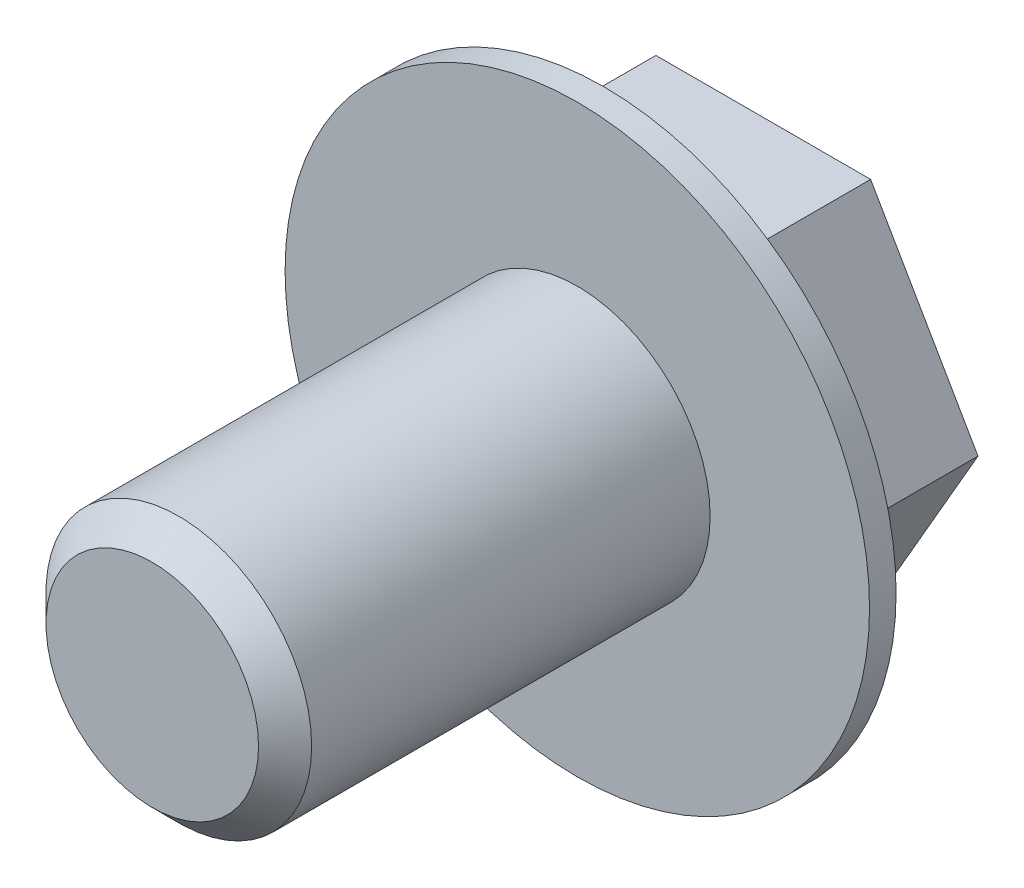
ISO-10303-21;
HEADER;
FILE_DESCRIPTION(('STEP AP214'),'2;1');
FILE_NAME('part.step','',(''),(''),'','','');
FILE_SCHEMA(('AUTOMOTIVE_DESIGN { 1 0 10303 214 1 1 1 1 }'));
ENDSEC;
DATA;
#1=APPLICATION_CONTEXT('core data for automotive mechanical design processes');
#2=APPLICATION_PROTOCOL_DEFINITION('international standard','automotive_design',2000,#1);
#3=PRODUCT_CONTEXT('',#1,'mechanical');
#4=PRODUCT('Part','Part','',(#3));
#5=PRODUCT_RELATED_PRODUCT_CATEGORY('part','',(#4));
#6=PRODUCT_DEFINITION_FORMATION('','',#4);
#7=PRODUCT_DEFINITION_CONTEXT('part definition',#1,'design');
#8=PRODUCT_DEFINITION('design','',#6,#7);
#9=PRODUCT_DEFINITION_SHAPE('','',#8);
#10=(LENGTH_UNIT() NAMED_UNIT(*) SI_UNIT(.MILLI.,.METRE.));
#11=(NAMED_UNIT(*) PLANE_ANGLE_UNIT() SI_UNIT($,.RADIAN.));
#12=(NAMED_UNIT(*) SI_UNIT($,.STERADIAN.) SOLID_ANGLE_UNIT());
#13=UNCERTAINTY_MEASURE_WITH_UNIT(LENGTH_MEASURE(1.E-05),#10,'distance_accuracy_value','');
#14=(GEOMETRIC_REPRESENTATION_CONTEXT(3) GLOBAL_UNCERTAINTY_ASSIGNED_CONTEXT((#13)) GLOBAL_UNIT_ASSIGNED_CONTEXT((#10,
#11,#12)) REPRESENTATION_CONTEXT('',''));
#15=CARTESIAN_POINT('',(0.,0.,0.));
#16=DIRECTION('',(0.,0.,1.));
#17=DIRECTION('',(1.,0.,0.));
#18=AXIS2_PLACEMENT_3D('',#15,#16,#17);
#19=CARTESIAN_POINT('',(0.,0.,8.));
#20=DIRECTION('',(0.,0.,-1.));
#21=DIRECTION('',(-1.,0.,0.));
#22=AXIS2_PLACEMENT_3D('',#19,#20,#21);
#23=CYLINDRICAL_SURFACE('',#22,2.5);
#24=CARTESIAN_POINT('',(0.,0.,7.5));
#25=DIRECTION('',(0.,0.,1.));
#26=DIRECTION('',(1.,0.,0.));
#27=AXIS2_PLACEMENT_3D('',#24,#25,#26);
#28=CIRCLE('',#27,2.5);
#29=CARTESIAN_POINT('',(2.5,0.,7.5));
#30=VERTEX_POINT('',#29);
#31=EDGE_CURVE('E11',#30,#30,#28,.F.);
#32=ORIENTED_EDGE('',*,*,#31,.T.);
#33=EDGE_LOOP('',(#32));
#34=FACE_BOUND('',#33,.T.);
#35=CARTESIAN_POINT('',(0.,0.,0.));
#36=DIRECTION('',(0.,0.,1.));
#37=DIRECTION('',(1.,0.,0.));
#38=AXIS2_PLACEMENT_3D('',#35,#36,#37);
#39=CIRCLE('',#38,2.5);
#40=CARTESIAN_POINT('',(2.5,0.,0.));
#41=VERTEX_POINT('',#40);
#42=EDGE_CURVE('E132',#41,#41,#39,.T.);
#43=ORIENTED_EDGE('',*,*,#42,.T.);
#44=EDGE_LOOP('',(#43));
#45=FACE_BOUND('',#44,.T.);
#46=ADVANCED_FACE('F41',(#34,#45),#23,.T.);
#47=CARTESIAN_POINT('',(0.,0.,8.));
#48=DIRECTION('',(0.,0.,1.));
#49=DIRECTION('',(1.,0.,0.));
#50=AXIS2_PLACEMENT_3D('',#47,#48,#49);
#51=PLANE('',#50);
#52=CARTESIAN_POINT('',(0.,0.,8.));
#53=DIRECTION('',(0.,0.,1.));
#54=DIRECTION('',(1.,0.,0.));
#55=AXIS2_PLACEMENT_3D('',#52,#53,#54);
#56=CIRCLE('',#55,2.);
#57=CARTESIAN_POINT('',(2.,0.,8.));
#58=VERTEX_POINT('',#57);
#59=EDGE_CURVE('E51',#58,#58,#56,.T.);
#60=ORIENTED_EDGE('',*,*,#59,.T.);
#61=EDGE_LOOP('',(#60));
#62=FACE_BOUND('',#61,.T.);
#63=ADVANCED_FACE('F140',(#62),#51,.T.);
#64=CARTESIAN_POINT('',(0.,0.,-0.5));
#65=DIRECTION('',(0.,0.,1.));
#66=DIRECTION('',(1.,0.,0.));
#67=AXIS2_PLACEMENT_3D('',#64,#65,#66);
#68=CYLINDRICAL_SURFACE('',#67,5.5);
#69=CARTESIAN_POINT('',(0.,0.,-0.5));
#70=DIRECTION('',(0.,0.,-1.));
#71=DIRECTION('',(-1.,0.,0.));
#72=AXIS2_PLACEMENT_3D('',#69,#70,#71);
#73=CIRCLE('',#72,5.5);
#74=CARTESIAN_POINT('',(-5.5,0.,-0.5));
#75=VERTEX_POINT('',#74);
#76=EDGE_CURVE('E124',#75,#75,#73,.T.);
#77=ORIENTED_EDGE('',*,*,#76,.F.);
#78=EDGE_LOOP('',(#77));
#79=FACE_BOUND('',#78,.T.);
#80=CARTESIAN_POINT('',(0.,0.,0.));
#81=DIRECTION('',(0.,0.,-1.));
#82=DIRECTION('',(-1.,0.,0.));
#83=AXIS2_PLACEMENT_3D('',#80,#81,#82);
#84=CIRCLE('',#83,5.5);
#85=CARTESIAN_POINT('',(-5.5,0.,0.));
#86=VERTEX_POINT('',#85);
#87=EDGE_CURVE('E119',#86,#86,#84,.T.);
#88=ORIENTED_EDGE('',*,*,#87,.T.);
#89=EDGE_LOOP('',(#88));
#90=FACE_BOUND('',#89,.T.);
#91=ADVANCED_FACE('F155',(#79,#90),#68,.T.);
#92=CARTESIAN_POINT('',(0.,0.,-0.5));
#93=DIRECTION('',(0.,0.,-1.));
#94=DIRECTION('',(-1.,0.,0.));
#95=AXIS2_PLACEMENT_3D('',#92,#93,#94);
#96=PLANE('',#95);
#97=DIRECTION('',(-0.5,0.866025403784439,0.));
#98=VECTOR('',#97,1.);
#99=CARTESIAN_POINT('',(-2.02072594216369,-3.5,-0.5));
#100=LINE('',#99,#98);
#101=CARTESIAN_POINT('',(-2.02072594216369,-3.5,-0.5));
#102=VERTEX_POINT('',#101);
#103=CARTESIAN_POINT('',(-4.04145188432738,0.,-0.5));
#104=VERTEX_POINT('',#103);
#105=EDGE_CURVE('E58',#102,#104,#100,.T.);
#106=ORIENTED_EDGE('',*,*,#105,.F.);
#107=DIRECTION('',(-1.,0.,0.));
#108=VECTOR('',#107,1.);
#109=CARTESIAN_POINT('',(2.02072594216369,-3.5,-0.5));
#110=LINE('',#109,#108);
#111=CARTESIAN_POINT('',(2.02072594216369,-3.5,-0.5));
#112=VERTEX_POINT('',#111);
#113=EDGE_CURVE('E62',#112,#102,#110,.T.);
#114=ORIENTED_EDGE('',*,*,#113,.F.);
#115=DIRECTION('',(-0.5,-0.866025403784439,0.));
#116=VECTOR('',#115,1.);
#117=CARTESIAN_POINT('',(4.04145188432738,0.,-0.5));
#118=LINE('',#117,#116);
#119=CARTESIAN_POINT('',(4.04145188432738,0.,-0.5));
#120=VERTEX_POINT('',#119);
#121=EDGE_CURVE('E194',#120,#112,#118,.T.);
#122=ORIENTED_EDGE('',*,*,#121,.F.);
#123=DIRECTION('',(0.5,-0.866025403784439,0.));
#124=VECTOR('',#123,1.);
#125=CARTESIAN_POINT('',(2.02072594216369,3.5,-0.5));
#126=LINE('',#125,#124);
#127=CARTESIAN_POINT('',(2.02072594216369,3.5,-0.5));
#128=VERTEX_POINT('',#127);
#129=EDGE_CURVE('E214',#128,#120,#126,.T.);
#130=ORIENTED_EDGE('',*,*,#129,.F.);
#131=DIRECTION('',(1.,0.,0.));
#132=VECTOR('',#131,1.);
#133=CARTESIAN_POINT('',(-2.02072594216369,3.5,-0.5));
#134=LINE('',#133,#132);
#135=CARTESIAN_POINT('',(-2.02072594216369,3.5,-0.5));
#136=VERTEX_POINT('',#135);
#137=EDGE_CURVE('E217',#136,#128,#134,.T.);
#138=ORIENTED_EDGE('',*,*,#137,.F.);
#139=DIRECTION('',(0.5,0.866025403784438,0.));
#140=VECTOR('',#139,1.);
#141=CARTESIAN_POINT('',(-4.04145188432738,0.,-0.5));
#142=LINE('',#141,#140);
#143=EDGE_CURVE('E219',#104,#136,#142,.T.);
#144=ORIENTED_EDGE('',*,*,#143,.F.);
#145=EDGE_LOOP('',(#106,#114,#122,#130,#138,#144));
#146=FACE_BOUND('',#145,.T.);
#147=ORIENTED_EDGE('',*,*,#76,.T.);
#148=EDGE_LOOP('',(#147));
#149=FACE_BOUND('',#148,.T.);
#150=ADVANCED_FACE('F161',(#146,#149),#96,.T.);
#151=CARTESIAN_POINT('',(0.,0.,0.));
#152=DIRECTION('',(0.,0.,-1.));
#153=DIRECTION('',(-1.,0.,0.));
#154=AXIS2_PLACEMENT_3D('',#151,#152,#153);
#155=PLANE('',#154);
#156=ORIENTED_EDGE('',*,*,#42,.F.);
#157=EDGE_LOOP('',(#156));
#158=FACE_BOUND('',#157,.T.);
#159=ORIENTED_EDGE('',*,*,#87,.F.);
#160=EDGE_LOOP('',(#159));
#161=FACE_BOUND('',#160,.T.);
#162=ADVANCED_FACE('F163',(#158,#161),#155,.F.);
#163=CARTESIAN_POINT('',(-2.02072594216369,-3.5,-3.5));
#164=DIRECTION('',(0.866025403784439,0.5,0.));
#165=DIRECTION('',(-0.5,0.866025403784439,0.));
#166=AXIS2_PLACEMENT_3D('',#163,#164,#165);
#167=PLANE('',#166);
#168=ORIENTED_EDGE('',*,*,#105,.T.);
#169=DIRECTION('',(0.,0.,1.));
#170=VECTOR('',#169,1.);
#171=CARTESIAN_POINT('',(-4.04145188432738,0.,-3.5));
#172=LINE('',#171,#170);
#173=CARTESIAN_POINT('',(-4.04145188432738,0.,-3.5));
#174=VERTEX_POINT('',#173);
#175=EDGE_CURVE('E99',#174,#104,#172,.T.);
#176=ORIENTED_EDGE('',*,*,#175,.F.);
#177=DIRECTION('',(-0.5,0.866025403784439,0.));
#178=VECTOR('',#177,1.);
#179=CARTESIAN_POINT('',(-2.02072594216369,-3.5,-3.5));
#180=LINE('',#179,#178);
#181=CARTESIAN_POINT('',(-2.02072594216369,-3.5,-3.5));
#182=VERTEX_POINT('',#181);
#183=EDGE_CURVE('E106',#182,#174,#180,.T.);
#184=ORIENTED_EDGE('',*,*,#183,.F.);
#185=DIRECTION('',(0.,0.,1.));
#186=VECTOR('',#185,1.);
#187=CARTESIAN_POINT('',(-2.02072594216369,-3.5,-3.5));
#188=LINE('',#187,#186);
#189=EDGE_CURVE('E190',#182,#102,#188,.T.);
#190=ORIENTED_EDGE('',*,*,#189,.T.);
#191=EDGE_LOOP('',(#168,#176,#184,#190));
#192=FACE_BOUND('',#191,.T.);
#193=ADVANCED_FACE('F117',(#192),#167,.F.);
#194=CARTESIAN_POINT('',(-4.04145188432738,0.,-3.5));
#195=DIRECTION('',(0.866025403784439,-0.5,0.));
#196=DIRECTION('',(0.5,0.866025403784439,0.));
#197=AXIS2_PLACEMENT_3D('',#194,#195,#196);
#198=PLANE('',#197);
#199=ORIENTED_EDGE('',*,*,#143,.T.);
#200=DIRECTION('',(0.,0.,1.));
#201=VECTOR('',#200,1.);
#202=CARTESIAN_POINT('',(-2.02072594216369,3.5,-3.5));
#203=LINE('',#202,#201);
#204=CARTESIAN_POINT('',(-2.02072594216369,3.5,-3.5));
#205=VERTEX_POINT('',#204);
#206=EDGE_CURVE('E101',#205,#136,#203,.T.);
#207=ORIENTED_EDGE('',*,*,#206,.F.);
#208=DIRECTION('',(0.5,0.866025403784438,0.));
#209=VECTOR('',#208,1.);
#210=CARTESIAN_POINT('',(-4.04145188432738,0.,-3.5));
#211=LINE('',#210,#209);
#212=EDGE_CURVE('E94',#174,#205,#211,.T.);
#213=ORIENTED_EDGE('',*,*,#212,.F.);
#214=ORIENTED_EDGE('',*,*,#175,.T.);
#215=EDGE_LOOP('',(#199,#207,#213,#214));
#216=FACE_BOUND('',#215,.T.);
#217=ADVANCED_FACE('F97',(#216),#198,.F.);
#218=CARTESIAN_POINT('',(-2.02072594216369,3.5,-3.5));
#219=DIRECTION('',(0.,-1.,0.));
#220=DIRECTION('',(1.,0.,0.));
#221=AXIS2_PLACEMENT_3D('',#218,#219,#220);
#222=PLANE('',#221);
#223=ORIENTED_EDGE('',*,*,#137,.T.);
#224=DIRECTION('',(0.,0.,1.));
#225=VECTOR('',#224,1.);
#226=CARTESIAN_POINT('',(2.02072594216369,3.5,-3.5));
#227=LINE('',#226,#225);
#228=CARTESIAN_POINT('',(2.02072594216369,3.5,-3.5));
#229=VERTEX_POINT('',#228);
#230=EDGE_CURVE('E126',#229,#128,#227,.T.);
#231=ORIENTED_EDGE('',*,*,#230,.F.);
#232=DIRECTION('',(1.,0.,0.));
#233=VECTOR('',#232,1.);
#234=CARTESIAN_POINT('',(-2.02072594216369,3.5,-3.5));
#235=LINE('',#234,#233);
#236=EDGE_CURVE('E105',#205,#229,#235,.T.);
#237=ORIENTED_EDGE('',*,*,#236,.F.);
#238=ORIENTED_EDGE('',*,*,#206,.T.);
#239=EDGE_LOOP('',(#223,#231,#237,#238));
#240=FACE_BOUND('',#239,.T.);
#241=ADVANCED_FACE('F173',(#240),#222,.F.);
#242=CARTESIAN_POINT('',(2.02072594216369,3.5,-3.5));
#243=DIRECTION('',(-0.866025403784439,-0.5,0.));
#244=DIRECTION('',(0.5,-0.866025403784439,0.));
#245=AXIS2_PLACEMENT_3D('',#242,#243,#244);
#246=PLANE('',#245);
#247=ORIENTED_EDGE('',*,*,#129,.T.);
#248=DIRECTION('',(0.,0.,1.));
#249=VECTOR('',#248,1.);
#250=CARTESIAN_POINT('',(4.04145188432738,0.,-3.5));
#251=LINE('',#250,#249);
#252=CARTESIAN_POINT('',(4.04145188432738,0.,-3.5));
#253=VERTEX_POINT('',#252);
#254=EDGE_CURVE('E200',#253,#120,#251,.T.);
#255=ORIENTED_EDGE('',*,*,#254,.F.);
#256=DIRECTION('',(0.5,-0.866025403784439,0.));
#257=VECTOR('',#256,1.);
#258=CARTESIAN_POINT('',(2.02072594216369,3.5,-3.5));
#259=LINE('',#258,#257);
#260=EDGE_CURVE('E215',#229,#253,#259,.T.);
#261=ORIENTED_EDGE('',*,*,#260,.F.);
#262=ORIENTED_EDGE('',*,*,#230,.T.);
#263=EDGE_LOOP('',(#247,#255,#261,#262));
#264=FACE_BOUND('',#263,.T.);
#265=ADVANCED_FACE('F176',(#264),#246,.F.);
#266=CARTESIAN_POINT('',(4.04145188432738,0.,-3.5));
#267=DIRECTION('',(-0.866025403784439,0.5,0.));
#268=DIRECTION('',(-0.5,-0.866025403784439,0.));
#269=AXIS2_PLACEMENT_3D('',#266,#267,#268);
#270=PLANE('',#269);
#271=ORIENTED_EDGE('',*,*,#121,.T.);
#272=DIRECTION('',(0.,0.,1.));
#273=VECTOR('',#272,1.);
#274=CARTESIAN_POINT('',(2.02072594216369,-3.5,-3.5));
#275=LINE('',#274,#273);
#276=CARTESIAN_POINT('',(2.02072594216369,-3.5,-3.5));
#277=VERTEX_POINT('',#276);
#278=EDGE_CURVE('E192',#277,#112,#275,.T.);
#279=ORIENTED_EDGE('',*,*,#278,.F.);
#280=DIRECTION('',(-0.5,-0.866025403784439,0.));
#281=VECTOR('',#280,1.);
#282=CARTESIAN_POINT('',(4.04145188432738,0.,-3.5));
#283=LINE('',#282,#281);
#284=EDGE_CURVE('E202',#253,#277,#283,.T.);
#285=ORIENTED_EDGE('',*,*,#284,.F.);
#286=ORIENTED_EDGE('',*,*,#254,.T.);
#287=EDGE_LOOP('',(#271,#279,#285,#286));
#288=FACE_BOUND('',#287,.T.);
#289=ADVANCED_FACE('F180',(#288),#270,.F.);
#290=CARTESIAN_POINT('',(2.02072594216369,-3.5,-3.5));
#291=DIRECTION('',(0.,1.,0.));
#292=DIRECTION('',(-1.,0.,0.));
#293=AXIS2_PLACEMENT_3D('',#290,#291,#292);
#294=PLANE('',#293);
#295=ORIENTED_EDGE('',*,*,#113,.T.);
#296=ORIENTED_EDGE('',*,*,#189,.F.);
#297=DIRECTION('',(-1.,0.,0.));
#298=VECTOR('',#297,1.);
#299=CARTESIAN_POINT('',(2.02072594216369,-3.5,-3.5));
#300=LINE('',#299,#298);
#301=EDGE_CURVE('E111',#277,#182,#300,.T.);
#302=ORIENTED_EDGE('',*,*,#301,.F.);
#303=ORIENTED_EDGE('',*,*,#278,.T.);
#304=EDGE_LOOP('',(#295,#296,#302,#303));
#305=FACE_BOUND('',#304,.T.);
#306=ADVANCED_FACE('F147',(#305),#294,.F.);
#307=CARTESIAN_POINT('',(0.,0.,-3.5));
#308=DIRECTION('',(0.,0.,-1.));
#309=DIRECTION('',(-1.,0.,0.));
#310=AXIS2_PLACEMENT_3D('',#307,#308,#309);
#311=PLANE('',#310);
#312=ORIENTED_EDGE('',*,*,#183,.T.);
#313=ORIENTED_EDGE('',*,*,#212,.T.);
#314=ORIENTED_EDGE('',*,*,#236,.T.);
#315=ORIENTED_EDGE('',*,*,#260,.T.);
#316=ORIENTED_EDGE('',*,*,#284,.T.);
#317=ORIENTED_EDGE('',*,*,#301,.T.);
#318=EDGE_LOOP('',(#312,#313,#314,#315,#316,#317));
#319=FACE_BOUND('',#318,.T.);
#320=ADVANCED_FACE('F109',(#319),#311,.T.);
#321=CARTESIAN_POINT('',(0.,0.,8.));
#322=DIRECTION('',(0.,0.,-1.));
#323=DIRECTION('',(-1.,0.,0.));
#324=AXIS2_PLACEMENT_3D('',#321,#322,#323);
#325=CONICAL_SURFACE('',#324,2.,0.785398163397446);
#326=ORIENTED_EDGE('',*,*,#31,.F.);
#327=EDGE_LOOP('',(#326));
#328=FACE_BOUND('',#327,.T.);
#329=ORIENTED_EDGE('',*,*,#59,.F.);
#330=EDGE_LOOP('',(#329));
#331=FACE_BOUND('',#330,.T.);
#332=ADVANCED_FACE('F44',(#328,#331),#325,.T.);
#333=CLOSED_SHELL('',(#46,#63,#91,#150,#162,#193,#217,#241,#265,#289,#306,#320,#332));
#334=MANIFOLD_SOLID_BREP('B2',#333);
#335=ADVANCED_BREP_SHAPE_REPRESENTATION('',(#18,#334),#14);
#336=SHAPE_DEFINITION_REPRESENTATION(#9,#335);
ENDSEC;
END-ISO-10303-21;
